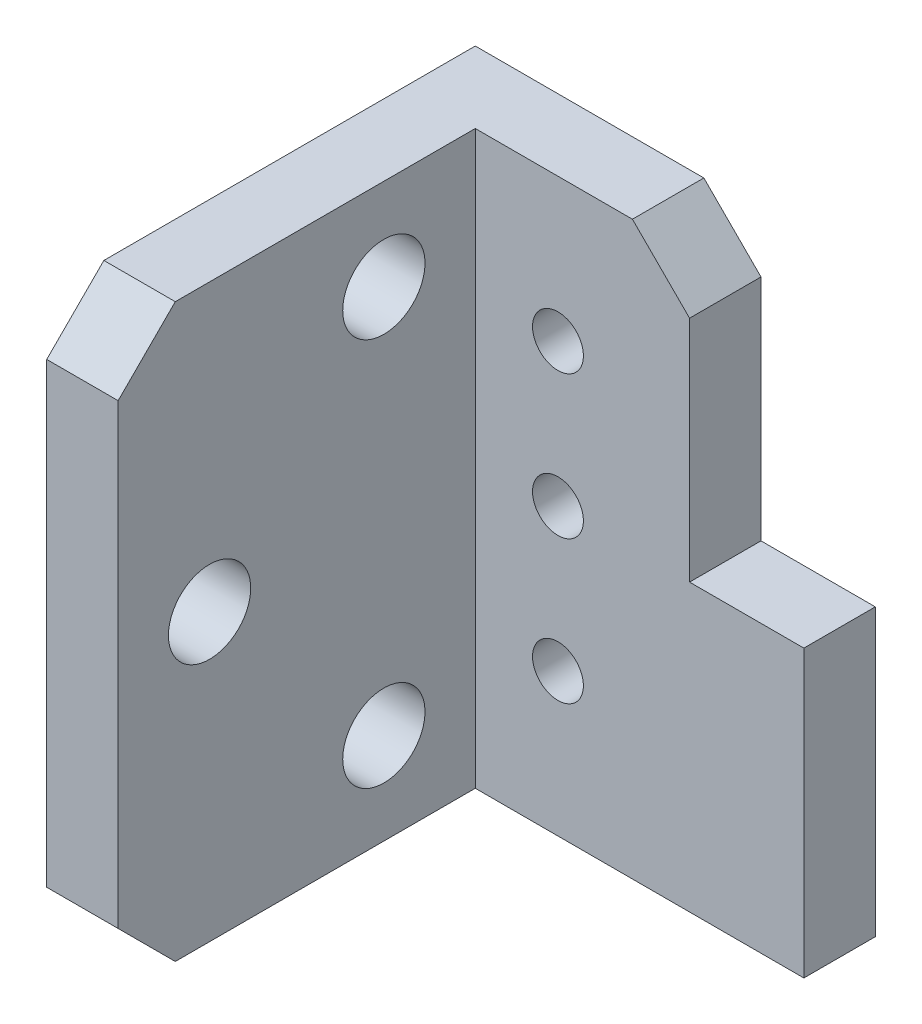
ISO-10303-21;
HEADER;
FILE_DESCRIPTION(('STEP AP214'),'2;1');
FILE_NAME('part.step','',(''),(''),'','','');
FILE_SCHEMA(('AUTOMOTIVE_DESIGN { 1 0 10303 214 1 1 1 1 }'));
ENDSEC;
DATA;
#1=APPLICATION_CONTEXT('core data for automotive mechanical design processes');
#2=APPLICATION_PROTOCOL_DEFINITION('international standard','automotive_design',2000,#1);
#3=PRODUCT_CONTEXT('',#1,'mechanical');
#4=PRODUCT('Part','Part','',(#3));
#5=PRODUCT_RELATED_PRODUCT_CATEGORY('part','',(#4));
#6=PRODUCT_DEFINITION_FORMATION('','',#4);
#7=PRODUCT_DEFINITION_CONTEXT('part definition',#1,'design');
#8=PRODUCT_DEFINITION('design','',#6,#7);
#9=PRODUCT_DEFINITION_SHAPE('','',#8);
#10=(LENGTH_UNIT() NAMED_UNIT(*) SI_UNIT(.MILLI.,.METRE.));
#11=(NAMED_UNIT(*) PLANE_ANGLE_UNIT() SI_UNIT($,.RADIAN.));
#12=(NAMED_UNIT(*) SI_UNIT($,.STERADIAN.) SOLID_ANGLE_UNIT());
#13=UNCERTAINTY_MEASURE_WITH_UNIT(LENGTH_MEASURE(1.E-05),#10,'distance_accuracy_value','');
#14=(GEOMETRIC_REPRESENTATION_CONTEXT(3) GLOBAL_UNCERTAINTY_ASSIGNED_CONTEXT((#13)) GLOBAL_UNIT_ASSIGNED_CONTEXT((#10,
#11,#12)) REPRESENTATION_CONTEXT('',''));
#15=CARTESIAN_POINT('',(0.,0.,0.));
#16=DIRECTION('',(0.,0.,1.));
#17=DIRECTION('',(1.,0.,0.));
#18=AXIS2_PLACEMENT_3D('',#15,#16,#17);
#19=CARTESIAN_POINT('',(0.,25.4,0.));
#20=DIRECTION('',(1.,0.,0.));
#21=DIRECTION('',(0.,0.,-1.));
#22=AXIS2_PLACEMENT_3D('',#19,#20,#21);
#23=PLANE('',#22);
#24=CARTESIAN_POINT('',(0.,4.064,7.239));
#25=DIRECTION('',(-1.,0.,0.));
#26=DIRECTION('',(0.,0.,1.));
#27=AXIS2_PLACEMENT_3D('',#24,#25,#26);
#28=CIRCLE('',#27,1.8288);
#29=CARTESIAN_POINT('',(0.,4.064,9.0678));
#30=VERTEX_POINT('',#29);
#31=EDGE_CURVE('E184',#30,#30,#28,.T.);
#32=ORIENTED_EDGE('',*,*,#31,.F.);
#33=EDGE_LOOP('',(#32));
#34=FACE_BOUND('',#33,.T.);
#35=CARTESIAN_POINT('',(0.,21.336,7.239));
#36=DIRECTION('',(-1.,0.,0.));
#37=DIRECTION('',(0.,0.,1.));
#38=AXIS2_PLACEMENT_3D('',#35,#36,#37);
#39=CIRCLE('',#38,1.8288);
#40=CARTESIAN_POINT('',(0.,21.336,9.0678));
#41=VERTEX_POINT('',#40);
#42=EDGE_CURVE('E188',#41,#41,#39,.T.);
#43=ORIENTED_EDGE('',*,*,#42,.F.);
#44=EDGE_LOOP('',(#43));
#45=FACE_BOUND('',#44,.T.);
#46=CARTESIAN_POINT('',(0.,12.7,14.986));
#47=DIRECTION('',(-1.,0.,0.));
#48=DIRECTION('',(0.,0.,1.));
#49=AXIS2_PLACEMENT_3D('',#46,#47,#48);
#50=CIRCLE('',#49,1.8288);
#51=CARTESIAN_POINT('',(0.,12.7,16.8148));
#52=VERTEX_POINT('',#51);
#53=EDGE_CURVE('E192',#52,#52,#50,.T.);
#54=ORIENTED_EDGE('',*,*,#53,.F.);
#55=EDGE_LOOP('',(#54));
#56=FACE_BOUND('',#55,.T.);
#57=DIRECTION('',(0.,0.,1.));
#58=VECTOR('',#57,1.);
#59=CARTESIAN_POINT('',(0.,0.,0.));
#60=LINE('',#59,#58);
#61=CARTESIAN_POINT('',(0.,0.,0.));
#62=VERTEX_POINT('',#61);
#63=CARTESIAN_POINT('',(0.,0.,16.51));
#64=VERTEX_POINT('',#63);
#65=EDGE_CURVE('E138',#62,#64,#60,.T.);
#66=ORIENTED_EDGE('',*,*,#65,.T.);
#67=DIRECTION('',(0.,-0.707106781186546,-0.707106781186549));
#68=VECTOR('',#67,1.);
#69=CARTESIAN_POINT('',(0.,2.54,19.05));
#70=LINE('',#69,#68);
#71=CARTESIAN_POINT('',(0.,2.54,19.05));
#72=VERTEX_POINT('',#71);
#73=EDGE_CURVE('E13',#64,#72,#70,.F.);
#74=ORIENTED_EDGE('',*,*,#73,.T.);
#75=DIRECTION('',(0.,-1.,0.));
#76=VECTOR('',#75,1.);
#77=CARTESIAN_POINT('',(0.,25.4,19.05));
#78=LINE('',#77,#76);
#79=CARTESIAN_POINT('',(0.,22.86,19.05));
#80=VERTEX_POINT('',#79);
#81=EDGE_CURVE('E224',#80,#72,#78,.T.);
#82=ORIENTED_EDGE('',*,*,#81,.F.);
#83=DIRECTION('',(0.,0.707106781186549,-0.707106781186546));
#84=VECTOR('',#83,1.);
#85=CARTESIAN_POINT('',(0.,25.4,16.51));
#86=LINE('',#85,#84);
#87=CARTESIAN_POINT('',(0.,25.4,16.51));
#88=VERTEX_POINT('',#87);
#89=EDGE_CURVE('E58',#80,#88,#86,.T.);
#90=ORIENTED_EDGE('',*,*,#89,.T.);
#91=DIRECTION('',(0.,0.,1.));
#92=VECTOR('',#91,1.);
#93=CARTESIAN_POINT('',(0.,25.4,0.));
#94=LINE('',#93,#92);
#95=CARTESIAN_POINT('',(0.,25.4,0.));
#96=VERTEX_POINT('',#95);
#97=EDGE_CURVE('E143',#96,#88,#94,.T.);
#98=ORIENTED_EDGE('',*,*,#97,.F.);
#99=DIRECTION('',(0.,-1.,0.));
#100=VECTOR('',#99,1.);
#101=CARTESIAN_POINT('',(0.,25.4,0.));
#102=LINE('',#101,#100);
#103=EDGE_CURVE('E207',#96,#62,#102,.T.);
#104=ORIENTED_EDGE('',*,*,#103,.T.);
#105=EDGE_LOOP('',(#66,#74,#82,#90,#98,#104));
#106=FACE_BOUND('',#105,.T.);
#107=ADVANCED_FACE('F49',(#34,#45,#56,#106),#23,.F.);
#108=CARTESIAN_POINT('',(0.,25.4,19.05));
#109=DIRECTION('',(0.,0.,-1.));
#110=DIRECTION('',(-1.,0.,0.));
#111=AXIS2_PLACEMENT_3D('',#108,#109,#110);
#112=PLANE('',#111);
#113=ORIENTED_EDGE('',*,*,#81,.T.);
#114=DIRECTION('',(1.,0.,0.));
#115=VECTOR('',#114,1.);
#116=CARTESIAN_POINT('',(0.,2.54,19.05));
#117=LINE('',#116,#115);
#118=CARTESIAN_POINT('',(3.175,2.54,19.05));
#119=VERTEX_POINT('',#118);
#120=EDGE_CURVE('E245',#72,#119,#117,.T.);
#121=ORIENTED_EDGE('',*,*,#120,.T.);
#122=DIRECTION('',(0.,-1.,0.));
#123=VECTOR('',#122,1.);
#124=CARTESIAN_POINT('',(3.175,25.4,19.05));
#125=LINE('',#124,#123);
#126=CARTESIAN_POINT('',(3.175,22.86,19.05));
#127=VERTEX_POINT('',#126);
#128=EDGE_CURVE('E221',#127,#119,#125,.T.);
#129=ORIENTED_EDGE('',*,*,#128,.F.);
#130=DIRECTION('',(-1.,0.,0.));
#131=VECTOR('',#130,1.);
#132=CARTESIAN_POINT('',(0.,22.86,19.05));
#133=LINE('',#132,#131);
#134=EDGE_CURVE('E70',#127,#80,#133,.T.);
#135=ORIENTED_EDGE('',*,*,#134,.T.);
#136=EDGE_LOOP('',(#113,#121,#129,#135));
#137=FACE_BOUND('',#136,.T.);
#138=ADVANCED_FACE('F263',(#137),#112,.F.);
#139=CARTESIAN_POINT('',(3.175,25.4,19.05));
#140=DIRECTION('',(-1.,0.,0.));
#141=DIRECTION('',(0.,0.,1.));
#142=AXIS2_PLACEMENT_3D('',#139,#140,#141);
#143=PLANE('',#142);
#144=CARTESIAN_POINT('',(3.175,4.064,7.239));
#145=DIRECTION('',(-1.,0.,0.));
#146=DIRECTION('',(0.,0.,1.));
#147=AXIS2_PLACEMENT_3D('',#144,#145,#146);
#148=CIRCLE('',#147,1.8288);
#149=CARTESIAN_POINT('',(3.175,4.064,9.0678));
#150=VERTEX_POINT('',#149);
#151=EDGE_CURVE('E187',#150,#150,#148,.T.);
#152=ORIENTED_EDGE('',*,*,#151,.T.);
#153=EDGE_LOOP('',(#152));
#154=FACE_BOUND('',#153,.T.);
#155=CARTESIAN_POINT('',(3.175,21.336,7.239));
#156=DIRECTION('',(-1.,0.,0.));
#157=DIRECTION('',(0.,0.,1.));
#158=AXIS2_PLACEMENT_3D('',#155,#156,#157);
#159=CIRCLE('',#158,1.8288);
#160=CARTESIAN_POINT('',(3.175,21.336,9.0678));
#161=VERTEX_POINT('',#160);
#162=EDGE_CURVE('E191',#161,#161,#159,.T.);
#163=ORIENTED_EDGE('',*,*,#162,.T.);
#164=EDGE_LOOP('',(#163));
#165=FACE_BOUND('',#164,.T.);
#166=CARTESIAN_POINT('',(3.175,12.7,14.986));
#167=DIRECTION('',(-1.,0.,0.));
#168=DIRECTION('',(0.,0.,1.));
#169=AXIS2_PLACEMENT_3D('',#166,#167,#168);
#170=CIRCLE('',#169,1.8288);
#171=CARTESIAN_POINT('',(3.175,12.7,16.8148));
#172=VERTEX_POINT('',#171);
#173=EDGE_CURVE('E195',#172,#172,#170,.T.);
#174=ORIENTED_EDGE('',*,*,#173,.T.);
#175=EDGE_LOOP('',(#174));
#176=FACE_BOUND('',#175,.T.);
#177=ORIENTED_EDGE('',*,*,#128,.T.);
#178=DIRECTION('',(0.,0.707106781186546,0.707106781186549));
#179=VECTOR('',#178,1.);
#180=CARTESIAN_POINT('',(3.175,2.54,19.05));
#181=LINE('',#180,#179);
#182=CARTESIAN_POINT('',(3.175,0.,16.51));
#183=VERTEX_POINT('',#182);
#184=EDGE_CURVE('E250',#119,#183,#181,.F.);
#185=ORIENTED_EDGE('',*,*,#184,.T.);
#186=DIRECTION('',(0.,0.,-1.));
#187=VECTOR('',#186,1.);
#188=CARTESIAN_POINT('',(3.175,0.,19.05));
#189=LINE('',#188,#187);
#190=CARTESIAN_POINT('',(3.175,0.,3.175));
#191=VERTEX_POINT('',#190);
#192=EDGE_CURVE('E209',#183,#191,#189,.T.);
#193=ORIENTED_EDGE('',*,*,#192,.T.);
#194=DIRECTION('',(0.,-1.,0.));
#195=VECTOR('',#194,1.);
#196=CARTESIAN_POINT('',(3.175,25.4,3.175));
#197=LINE('',#196,#195);
#198=CARTESIAN_POINT('',(3.175,25.4,3.175));
#199=VERTEX_POINT('',#198);
#200=EDGE_CURVE('E218',#199,#191,#197,.T.);
#201=ORIENTED_EDGE('',*,*,#200,.F.);
#202=DIRECTION('',(0.,0.,-1.));
#203=VECTOR('',#202,1.);
#204=CARTESIAN_POINT('',(3.175,25.4,19.05));
#205=LINE('',#204,#203);
#206=CARTESIAN_POINT('',(3.175,25.4,16.51));
#207=VERTEX_POINT('',#206);
#208=EDGE_CURVE('E200',#207,#199,#205,.T.);
#209=ORIENTED_EDGE('',*,*,#208,.F.);
#210=DIRECTION('',(0.,-0.707106781186549,0.707106781186546));
#211=VECTOR('',#210,1.);
#212=CARTESIAN_POINT('',(3.175,25.4,16.51));
#213=LINE('',#212,#211);
#214=EDGE_CURVE('E248',#207,#127,#213,.T.);
#215=ORIENTED_EDGE('',*,*,#214,.T.);
#216=EDGE_LOOP('',(#177,#185,#193,#201,#209,#215));
#217=FACE_BOUND('',#216,.T.);
#218=ADVANCED_FACE('F261',(#154,#165,#176,#217),#143,.F.);
#219=CARTESIAN_POINT('',(12.7,25.4,3.175));
#220=DIRECTION('',(0.,0.,-1.));
#221=DIRECTION('',(-1.,0.,0.));
#222=AXIS2_PLACEMENT_3D('',#219,#220,#221);
#223=PLANE('',#222);
#224=DIRECTION('',(-1.,0.,0.));
#225=VECTOR('',#224,1.);
#226=CARTESIAN_POINT('',(17.78,12.7,3.175));
#227=LINE('',#226,#225);
#228=CARTESIAN_POINT('',(17.78,12.7,3.175));
#229=VERTEX_POINT('',#228);
#230=CARTESIAN_POINT('',(12.7,12.7,3.175));
#231=VERTEX_POINT('',#230);
#232=EDGE_CURVE('E164',#229,#231,#227,.T.);
#233=ORIENTED_EDGE('',*,*,#232,.T.);
#234=DIRECTION('',(0.,-1.,0.));
#235=VECTOR('',#234,1.);
#236=CARTESIAN_POINT('',(12.7,25.4,3.175));
#237=LINE('',#236,#235);
#238=CARTESIAN_POINT('',(12.7,22.86,3.175));
#239=VERTEX_POINT('',#238);
#240=EDGE_CURVE('E215',#239,#231,#237,.T.);
#241=ORIENTED_EDGE('',*,*,#240,.F.);
#242=DIRECTION('',(-0.707106781186547,0.707106781186548,0.));
#243=VECTOR('',#242,1.);
#244=CARTESIAN_POINT('',(10.16,25.4,3.175));
#245=LINE('',#244,#243);
#246=CARTESIAN_POINT('',(10.16,25.4,3.175));
#247=VERTEX_POINT('',#246);
#248=EDGE_CURVE('E236',#239,#247,#245,.T.);
#249=ORIENTED_EDGE('',*,*,#248,.T.);
#250=DIRECTION('',(1.,0.,0.));
#251=VECTOR('',#250,1.);
#252=CARTESIAN_POINT('',(12.7,25.4,3.175));
#253=LINE('',#252,#251);
#254=EDGE_CURVE('E202',#199,#247,#253,.T.);
#255=ORIENTED_EDGE('',*,*,#254,.F.);
#256=ORIENTED_EDGE('',*,*,#200,.T.);
#257=DIRECTION('',(1.,0.,0.));
#258=VECTOR('',#257,1.);
#259=CARTESIAN_POINT('',(12.7,0.,3.175));
#260=LINE('',#259,#258);
#261=CARTESIAN_POINT('',(17.78,0.,3.175));
#262=VERTEX_POINT('',#261);
#263=EDGE_CURVE('E144',#191,#262,#260,.T.);
#264=ORIENTED_EDGE('',*,*,#263,.T.);
#265=DIRECTION('',(0.,1.,0.));
#266=VECTOR('',#265,1.);
#267=CARTESIAN_POINT('',(17.78,12.7,3.175));
#268=LINE('',#267,#266);
#269=EDGE_CURVE('E152',#262,#229,#268,.T.);
#270=ORIENTED_EDGE('',*,*,#269,.T.);
#271=EDGE_LOOP('',(#233,#241,#249,#255,#256,#264,#270));
#272=FACE_BOUND('',#271,.T.);
#273=CARTESIAN_POINT('',(6.84999440000347,6.35,3.175));
#274=DIRECTION('',(0.,0.,-1.));
#275=DIRECTION('',(-1.,0.,0.));
#276=AXIS2_PLACEMENT_3D('',#273,#274,#275);
#277=CIRCLE('',#276,1.13029999999999);
#278=CARTESIAN_POINT('',(5.71969440000349,6.35,3.175));
#279=VERTEX_POINT('',#278);
#280=EDGE_CURVE('E53',#279,#279,#277,.T.);
#281=ORIENTED_EDGE('',*,*,#280,.T.);
#282=EDGE_LOOP('',(#281));
#283=FACE_BOUND('',#282,.T.);
#284=CARTESIAN_POINT('',(6.84999440000347,12.7,3.175));
#285=DIRECTION('',(0.,0.,-1.));
#286=DIRECTION('',(-1.,0.,0.));
#287=AXIS2_PLACEMENT_3D('',#284,#285,#286);
#288=CIRCLE('',#287,1.13029999999999);
#289=CARTESIAN_POINT('',(5.71969440000349,12.7,3.175));
#290=VERTEX_POINT('',#289);
#291=EDGE_CURVE('E175',#290,#290,#288,.T.);
#292=ORIENTED_EDGE('',*,*,#291,.T.);
#293=EDGE_LOOP('',(#292));
#294=FACE_BOUND('',#293,.T.);
#295=CARTESIAN_POINT('',(6.84999440000347,19.05,3.175));
#296=DIRECTION('',(0.,0.,-1.));
#297=DIRECTION('',(-1.,0.,0.));
#298=AXIS2_PLACEMENT_3D('',#295,#296,#297);
#299=CIRCLE('',#298,1.13029999999999);
#300=CARTESIAN_POINT('',(5.71969440000349,19.05,3.175));
#301=VERTEX_POINT('',#300);
#302=EDGE_CURVE('E181',#301,#301,#299,.T.);
#303=ORIENTED_EDGE('',*,*,#302,.T.);
#304=EDGE_LOOP('',(#303));
#305=FACE_BOUND('',#304,.T.);
#306=ADVANCED_FACE('F271',(#272,#283,#294,#305),#223,.F.);
#307=CARTESIAN_POINT('',(12.7,25.4,0.));
#308=DIRECTION('',(-1.,0.,0.));
#309=DIRECTION('',(0.,0.,1.));
#310=AXIS2_PLACEMENT_3D('',#307,#308,#309);
#311=PLANE('',#310);
#312=ORIENTED_EDGE('',*,*,#240,.T.);
#313=DIRECTION('',(0.,0.,-1.));
#314=VECTOR('',#313,1.);
#315=CARTESIAN_POINT('',(12.7,12.7,0.));
#316=LINE('',#315,#314);
#317=CARTESIAN_POINT('',(12.7,12.7,0.));
#318=VERTEX_POINT('',#317);
#319=EDGE_CURVE('E166',#231,#318,#316,.T.);
#320=ORIENTED_EDGE('',*,*,#319,.T.);
#321=DIRECTION('',(0.,-1.,0.));
#322=VECTOR('',#321,1.);
#323=CARTESIAN_POINT('',(12.7,25.4,0.));
#324=LINE('',#323,#322);
#325=CARTESIAN_POINT('',(12.7,22.86,0.));
#326=VERTEX_POINT('',#325);
#327=EDGE_CURVE('E213',#326,#318,#324,.T.);
#328=ORIENTED_EDGE('',*,*,#327,.F.);
#329=DIRECTION('',(0.,0.,1.));
#330=VECTOR('',#329,1.);
#331=CARTESIAN_POINT('',(12.7,22.86,3.175));
#332=LINE('',#331,#330);
#333=EDGE_CURVE('E226',#326,#239,#332,.T.);
#334=ORIENTED_EDGE('',*,*,#333,.T.);
#335=EDGE_LOOP('',(#312,#320,#328,#334));
#336=FACE_BOUND('',#335,.T.);
#337=ADVANCED_FACE('F283',(#336),#311,.F.);
#338=CARTESIAN_POINT('',(0.,25.4,0.));
#339=DIRECTION('',(0.,0.,1.));
#340=DIRECTION('',(1.,0.,0.));
#341=AXIS2_PLACEMENT_3D('',#338,#339,#340);
#342=PLANE('',#341);
#343=CARTESIAN_POINT('',(6.84999440000347,6.35,0.));
#344=DIRECTION('',(0.,0.,-1.));
#345=DIRECTION('',(-1.,0.,0.));
#346=AXIS2_PLACEMENT_3D('',#343,#344,#345);
#347=CIRCLE('',#346,1.13029999999999);
#348=CARTESIAN_POINT('',(5.71969440000349,6.35,0.));
#349=VERTEX_POINT('',#348);
#350=EDGE_CURVE('E169',#349,#349,#347,.T.);
#351=ORIENTED_EDGE('',*,*,#350,.F.);
#352=EDGE_LOOP('',(#351));
#353=FACE_BOUND('',#352,.T.);
#354=CARTESIAN_POINT('',(6.84999440000347,12.7,0.));
#355=DIRECTION('',(0.,0.,-1.));
#356=DIRECTION('',(-1.,0.,0.));
#357=AXIS2_PLACEMENT_3D('',#354,#355,#356);
#358=CIRCLE('',#357,1.13029999999999);
#359=CARTESIAN_POINT('',(5.71969440000349,12.7,0.));
#360=VERTEX_POINT('',#359);
#361=EDGE_CURVE('E172',#360,#360,#358,.T.);
#362=ORIENTED_EDGE('',*,*,#361,.F.);
#363=EDGE_LOOP('',(#362));
#364=FACE_BOUND('',#363,.T.);
#365=CARTESIAN_POINT('',(6.84999440000347,19.05,0.));
#366=DIRECTION('',(0.,0.,-1.));
#367=DIRECTION('',(-1.,0.,0.));
#368=AXIS2_PLACEMENT_3D('',#365,#366,#367);
#369=CIRCLE('',#368,1.13029999999999);
#370=CARTESIAN_POINT('',(5.71969440000349,19.05,0.));
#371=VERTEX_POINT('',#370);
#372=EDGE_CURVE('E178',#371,#371,#369,.T.);
#373=ORIENTED_EDGE('',*,*,#372,.F.);
#374=EDGE_LOOP('',(#373));
#375=FACE_BOUND('',#374,.T.);
#376=ORIENTED_EDGE('',*,*,#327,.T.);
#377=DIRECTION('',(1.,0.,0.));
#378=VECTOR('',#377,1.);
#379=CARTESIAN_POINT('',(17.78,12.7,0.));
#380=LINE('',#379,#378);
#381=CARTESIAN_POINT('',(17.78,12.7,0.));
#382=VERTEX_POINT('',#381);
#383=EDGE_CURVE('E154',#318,#382,#380,.T.);
#384=ORIENTED_EDGE('',*,*,#383,.T.);
#385=DIRECTION('',(0.,-1.,0.));
#386=VECTOR('',#385,1.);
#387=CARTESIAN_POINT('',(17.78,12.7,0.));
#388=LINE('',#387,#386);
#389=CARTESIAN_POINT('',(17.78,0.,0.));
#390=VERTEX_POINT('',#389);
#391=EDGE_CURVE('E151',#382,#390,#388,.T.);
#392=ORIENTED_EDGE('',*,*,#391,.T.);
#393=DIRECTION('',(-1.,0.,0.));
#394=VECTOR('',#393,1.);
#395=CARTESIAN_POINT('',(0.,0.,0.));
#396=LINE('',#395,#394);
#397=EDGE_CURVE('E133',#390,#62,#396,.T.);
#398=ORIENTED_EDGE('',*,*,#397,.T.);
#399=ORIENTED_EDGE('',*,*,#103,.F.);
#400=DIRECTION('',(-1.,0.,0.));
#401=VECTOR('',#400,1.);
#402=CARTESIAN_POINT('',(0.,25.4,0.));
#403=LINE('',#402,#401);
#404=CARTESIAN_POINT('',(10.16,25.4,0.));
#405=VERTEX_POINT('',#404);
#406=EDGE_CURVE('E205',#405,#96,#403,.T.);
#407=ORIENTED_EDGE('',*,*,#406,.F.);
#408=DIRECTION('',(0.707106781186547,-0.707106781186548,0.));
#409=VECTOR('',#408,1.);
#410=CARTESIAN_POINT('',(10.16,25.4,0.));
#411=LINE('',#410,#409);
#412=EDGE_CURVE('E232',#405,#326,#411,.T.);
#413=ORIENTED_EDGE('',*,*,#412,.T.);
#414=EDGE_LOOP('',(#376,#384,#392,#398,#399,#407,#413));
#415=FACE_BOUND('',#414,.T.);
#416=ADVANCED_FACE('F157',(#353,#364,#375,#415),#342,.F.);
#417=CARTESIAN_POINT('',(0.,25.4,0.));
#418=DIRECTION('',(0.,1.,0.));
#419=DIRECTION('',(0.,0.,1.));
#420=AXIS2_PLACEMENT_3D('',#417,#418,#419);
#421=PLANE('',#420);
#422=ORIENTED_EDGE('',*,*,#254,.T.);
#423=DIRECTION('',(0.,0.,-1.));
#424=VECTOR('',#423,1.);
#425=CARTESIAN_POINT('',(10.16,25.4,0.));
#426=LINE('',#425,#424);
#427=EDGE_CURVE('E241',#247,#405,#426,.T.);
#428=ORIENTED_EDGE('',*,*,#427,.T.);
#429=ORIENTED_EDGE('',*,*,#406,.T.);
#430=ORIENTED_EDGE('',*,*,#97,.T.);
#431=DIRECTION('',(1.,0.,0.));
#432=VECTOR('',#431,1.);
#433=CARTESIAN_POINT('',(3.175,25.4,16.51));
#434=LINE('',#433,#432);
#435=EDGE_CURVE('E238',#88,#207,#434,.T.);
#436=ORIENTED_EDGE('',*,*,#435,.T.);
#437=ORIENTED_EDGE('',*,*,#208,.T.);
#438=EDGE_LOOP('',(#422,#428,#429,#430,#436,#437));
#439=FACE_BOUND('',#438,.T.);
#440=ADVANCED_FACE('F257',(#439),#421,.T.);
#441=CARTESIAN_POINT('',(0.,0.,0.));
#442=DIRECTION('',(0.,1.,0.));
#443=DIRECTION('',(0.,0.,1.));
#444=AXIS2_PLACEMENT_3D('',#441,#442,#443);
#445=PLANE('',#444);
#446=ORIENTED_EDGE('',*,*,#397,.F.);
#447=DIRECTION('',(0.,0.,-1.));
#448=VECTOR('',#447,1.);
#449=CARTESIAN_POINT('',(17.78,0.,17.9856178129071));
#450=LINE('',#449,#448);
#451=EDGE_CURVE('E137',#262,#390,#450,.T.);
#452=ORIENTED_EDGE('',*,*,#451,.F.);
#453=ORIENTED_EDGE('',*,*,#263,.F.);
#454=ORIENTED_EDGE('',*,*,#192,.F.);
#455=DIRECTION('',(-1.,0.,0.));
#456=VECTOR('',#455,1.);
#457=CARTESIAN_POINT('',(0.,0.,16.51));
#458=LINE('',#457,#456);
#459=EDGE_CURVE('E234',#183,#64,#458,.T.);
#460=ORIENTED_EDGE('',*,*,#459,.T.);
#461=ORIENTED_EDGE('',*,*,#65,.F.);
#462=EDGE_LOOP('',(#446,#452,#453,#454,#460,#461));
#463=FACE_BOUND('',#462,.T.);
#464=ADVANCED_FACE('F135',(#463),#445,.F.);
#465=CARTESIAN_POINT('',(0.,12.7,14.986));
#466=DIRECTION('',(-1.,0.,0.));
#467=DIRECTION('',(0.,0.,1.));
#468=AXIS2_PLACEMENT_3D('',#465,#466,#467);
#469=CYLINDRICAL_SURFACE('',#468,1.8288);
#470=ORIENTED_EDGE('',*,*,#53,.T.);
#471=EDGE_LOOP('',(#470));
#472=FACE_BOUND('',#471,.T.);
#473=ORIENTED_EDGE('',*,*,#173,.F.);
#474=EDGE_LOOP('',(#473));
#475=FACE_BOUND('',#474,.T.);
#476=ADVANCED_FACE('F333',(#472,#475),#469,.F.);
#477=CARTESIAN_POINT('',(0.,21.336,7.239));
#478=DIRECTION('',(-1.,0.,0.));
#479=DIRECTION('',(0.,0.,1.));
#480=AXIS2_PLACEMENT_3D('',#477,#478,#479);
#481=CYLINDRICAL_SURFACE('',#480,1.8288);
#482=ORIENTED_EDGE('',*,*,#42,.T.);
#483=EDGE_LOOP('',(#482));
#484=FACE_BOUND('',#483,.T.);
#485=ORIENTED_EDGE('',*,*,#162,.F.);
#486=EDGE_LOOP('',(#485));
#487=FACE_BOUND('',#486,.T.);
#488=ADVANCED_FACE('F329',(#484,#487),#481,.F.);
#489=CARTESIAN_POINT('',(0.,4.064,7.239));
#490=DIRECTION('',(-1.,0.,0.));
#491=DIRECTION('',(0.,0.,1.));
#492=AXIS2_PLACEMENT_3D('',#489,#490,#491);
#493=CYLINDRICAL_SURFACE('',#492,1.8288);
#494=ORIENTED_EDGE('',*,*,#31,.T.);
#495=EDGE_LOOP('',(#494));
#496=FACE_BOUND('',#495,.T.);
#497=ORIENTED_EDGE('',*,*,#151,.F.);
#498=EDGE_LOOP('',(#497));
#499=FACE_BOUND('',#498,.T.);
#500=ADVANCED_FACE('F309',(#496,#499),#493,.F.);
#501=CARTESIAN_POINT('',(10.16,25.4,0.));
#502=DIRECTION('',(0.707106781186548,0.707106781186547,0.));
#503=DIRECTION('',(0.,0.,1.));
#504=AXIS2_PLACEMENT_3D('',#501,#502,#503);
#505=PLANE('',#504);
#506=ORIENTED_EDGE('',*,*,#248,.F.);
#507=ORIENTED_EDGE('',*,*,#333,.F.);
#508=ORIENTED_EDGE('',*,*,#412,.F.);
#509=ORIENTED_EDGE('',*,*,#427,.F.);
#510=EDGE_LOOP('',(#506,#507,#508,#509));
#511=FACE_BOUND('',#510,.T.);
#512=ADVANCED_FACE('F279',(#511),#505,.T.);
#513=CARTESIAN_POINT('',(0.,2.54,19.05));
#514=DIRECTION('',(0.,0.707106781186549,-0.707106781186546));
#515=DIRECTION('',(1.,0.,0.));
#516=AXIS2_PLACEMENT_3D('',#513,#514,#515);
#517=PLANE('',#516);
#518=ORIENTED_EDGE('',*,*,#73,.F.);
#519=ORIENTED_EDGE('',*,*,#459,.F.);
#520=ORIENTED_EDGE('',*,*,#184,.F.);
#521=ORIENTED_EDGE('',*,*,#120,.F.);
#522=EDGE_LOOP('',(#518,#519,#520,#521));
#523=FACE_BOUND('',#522,.T.);
#524=ADVANCED_FACE('F266',(#523),#517,.F.);
#525=CARTESIAN_POINT('',(0.,25.4,16.51));
#526=DIRECTION('',(0.,0.707106781186546,0.707106781186549));
#527=DIRECTION('',(-1.,0.,0.));
#528=AXIS2_PLACEMENT_3D('',#525,#526,#527);
#529=PLANE('',#528);
#530=ORIENTED_EDGE('',*,*,#89,.F.);
#531=ORIENTED_EDGE('',*,*,#134,.F.);
#532=ORIENTED_EDGE('',*,*,#214,.F.);
#533=ORIENTED_EDGE('',*,*,#435,.F.);
#534=EDGE_LOOP('',(#530,#531,#532,#533));
#535=FACE_BOUND('',#534,.T.);
#536=ADVANCED_FACE('F51',(#535),#529,.T.);
#537=CARTESIAN_POINT('',(6.84999440000347,19.05,0.));
#538=DIRECTION('',(0.,0.,-1.));
#539=DIRECTION('',(-1.,0.,0.));
#540=AXIS2_PLACEMENT_3D('',#537,#538,#539);
#541=CYLINDRICAL_SURFACE('',#540,1.13029999999999);
#542=ORIENTED_EDGE('',*,*,#372,.T.);
#543=EDGE_LOOP('',(#542));
#544=FACE_BOUND('',#543,.T.);
#545=ORIENTED_EDGE('',*,*,#302,.F.);
#546=EDGE_LOOP('',(#545));
#547=FACE_BOUND('',#546,.T.);
#548=ADVANCED_FACE('F314',(#544,#547),#541,.F.);
#549=CARTESIAN_POINT('',(6.84999440000347,12.7,0.));
#550=DIRECTION('',(0.,0.,-1.));
#551=DIRECTION('',(-1.,0.,0.));
#552=AXIS2_PLACEMENT_3D('',#549,#550,#551);
#553=CYLINDRICAL_SURFACE('',#552,1.13029999999999);
#554=ORIENTED_EDGE('',*,*,#361,.T.);
#555=EDGE_LOOP('',(#554));
#556=FACE_BOUND('',#555,.T.);
#557=ORIENTED_EDGE('',*,*,#291,.F.);
#558=EDGE_LOOP('',(#557));
#559=FACE_BOUND('',#558,.T.);
#560=ADVANCED_FACE('F294',(#556,#559),#553,.F.);
#561=CARTESIAN_POINT('',(6.84999440000347,6.35,0.));
#562=DIRECTION('',(0.,0.,-1.));
#563=DIRECTION('',(-1.,0.,0.));
#564=AXIS2_PLACEMENT_3D('',#561,#562,#563);
#565=CYLINDRICAL_SURFACE('',#564,1.13029999999999);
#566=ORIENTED_EDGE('',*,*,#350,.T.);
#567=EDGE_LOOP('',(#566));
#568=FACE_BOUND('',#567,.T.);
#569=ORIENTED_EDGE('',*,*,#280,.F.);
#570=EDGE_LOOP('',(#569));
#571=FACE_BOUND('',#570,.T.);
#572=ADVANCED_FACE('F287',(#568,#571),#565,.F.);
#573=CARTESIAN_POINT('',(17.78,12.7,17.9856178129071));
#574=DIRECTION('',(0.,1.,0.));
#575=DIRECTION('',(0.,0.,1.));
#576=AXIS2_PLACEMENT_3D('',#573,#574,#575);
#577=PLANE('',#576);
#578=ORIENTED_EDGE('',*,*,#319,.F.);
#579=ORIENTED_EDGE('',*,*,#232,.F.);
#580=DIRECTION('',(0.,0.,-1.));
#581=VECTOR('',#580,1.);
#582=CARTESIAN_POINT('',(17.78,12.7,17.9856178129071));
#583=LINE('',#582,#581);
#584=EDGE_CURVE('E153',#229,#382,#583,.T.);
#585=ORIENTED_EDGE('',*,*,#584,.T.);
#586=ORIENTED_EDGE('',*,*,#383,.F.);
#587=EDGE_LOOP('',(#578,#579,#585,#586));
#588=FACE_BOUND('',#587,.T.);
#589=ADVANCED_FACE('F285',(#588),#577,.T.);
#590=CARTESIAN_POINT('',(17.78,12.7,17.9856178129071));
#591=DIRECTION('',(1.,0.,0.));
#592=DIRECTION('',(0.,0.,-1.));
#593=AXIS2_PLACEMENT_3D('',#590,#591,#592);
#594=PLANE('',#593);
#595=ORIENTED_EDGE('',*,*,#269,.F.);
#596=ORIENTED_EDGE('',*,*,#451,.T.);
#597=ORIENTED_EDGE('',*,*,#391,.F.);
#598=ORIENTED_EDGE('',*,*,#584,.F.);
#599=EDGE_LOOP('',(#595,#596,#597,#598));
#600=FACE_BOUND('',#599,.T.);
#601=ADVANCED_FACE('F149',(#600),#594,.T.);
#602=CLOSED_SHELL('',(#107,#138,#218,#306,#337,#416,#440,#464,#476,#488,#500,#512,#524,#536,
#548,#560,#572,#589,#601));
#603=MANIFOLD_SOLID_BREP('B2',#602);
#604=ADVANCED_BREP_SHAPE_REPRESENTATION('',(#18,#603),#14);
#605=SHAPE_DEFINITION_REPRESENTATION(#9,#604);
ENDSEC;
END-ISO-10303-21;
